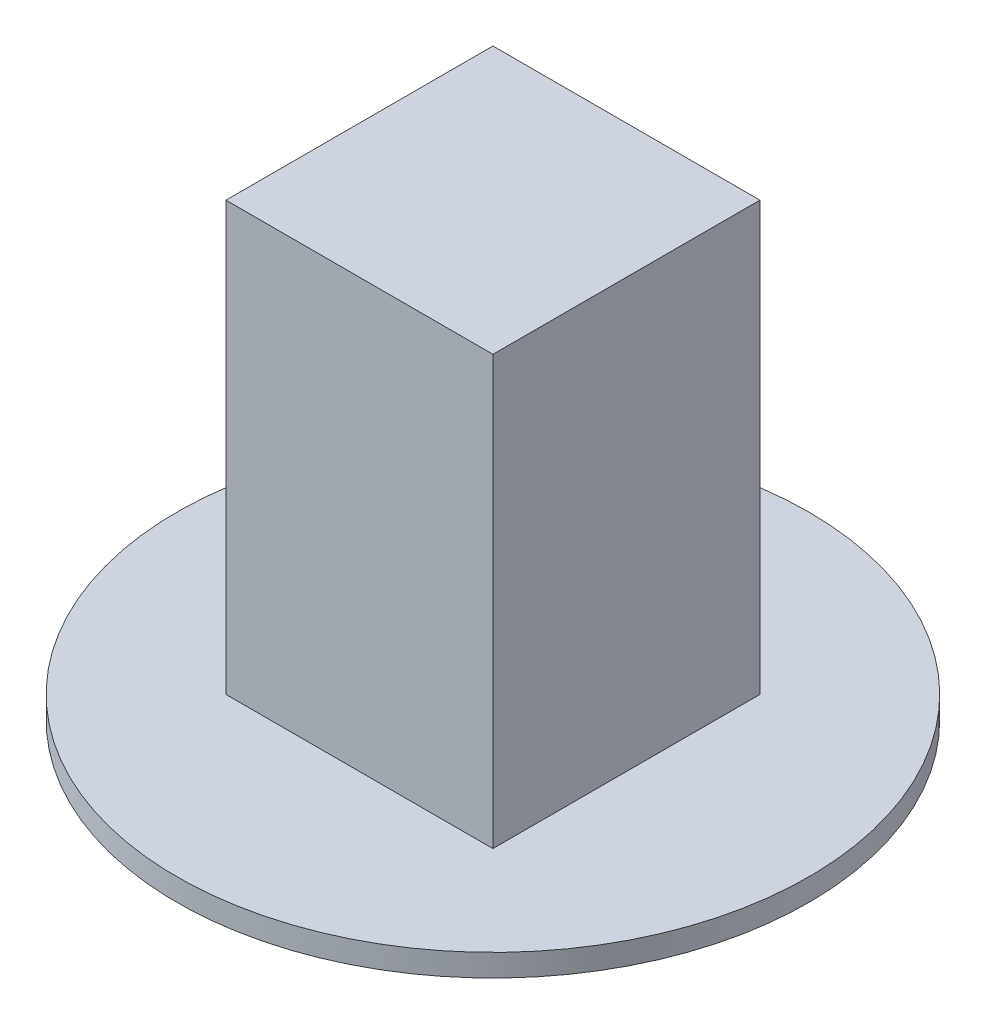
ISO-10303-21;
HEADER;
FILE_DESCRIPTION(('STEP AP214'),'2;1');
FILE_NAME('part.step','',(''),(''),'','','');
FILE_SCHEMA(('AUTOMOTIVE_DESIGN { 1 0 10303 214 1 1 1 1 }'));
ENDSEC;
DATA;
#1=APPLICATION_CONTEXT('core data for automotive mechanical design processes');
#2=APPLICATION_PROTOCOL_DEFINITION('international standard','automotive_design',2000,#1);
#3=PRODUCT_CONTEXT('',#1,'mechanical');
#4=PRODUCT('Part','Part','',(#3));
#5=PRODUCT_RELATED_PRODUCT_CATEGORY('part','',(#4));
#6=PRODUCT_DEFINITION_FORMATION('','',#4);
#7=PRODUCT_DEFINITION_CONTEXT('part definition',#1,'design');
#8=PRODUCT_DEFINITION('design','',#6,#7);
#9=PRODUCT_DEFINITION_SHAPE('','',#8);
#10=(LENGTH_UNIT() NAMED_UNIT(*) SI_UNIT(.MILLI.,.METRE.));
#11=(NAMED_UNIT(*) PLANE_ANGLE_UNIT() SI_UNIT($,.RADIAN.));
#12=(NAMED_UNIT(*) SI_UNIT($,.STERADIAN.) SOLID_ANGLE_UNIT());
#13=UNCERTAINTY_MEASURE_WITH_UNIT(LENGTH_MEASURE(1.E-05),#10,'distance_accuracy_value','');
#14=(GEOMETRIC_REPRESENTATION_CONTEXT(3) GLOBAL_UNCERTAINTY_ASSIGNED_CONTEXT((#13)) GLOBAL_UNIT_ASSIGNED_CONTEXT((#10,
#11,#12)) REPRESENTATION_CONTEXT('',''));
#15=CARTESIAN_POINT('',(0.,0.,0.));
#16=DIRECTION('',(0.,0.,1.));
#17=DIRECTION('',(1.,0.,0.));
#18=AXIS2_PLACEMENT_3D('',#15,#16,#17);
#19=CARTESIAN_POINT('',(-19.05,61.087,-19.05));
#20=DIRECTION('',(1.,0.,0.));
#21=DIRECTION('',(0.,0.,-1.));
#22=AXIS2_PLACEMENT_3D('',#19,#20,#21);
#23=PLANE('',#22);
#24=DIRECTION('',(0.,0.,1.));
#25=VECTOR('',#24,1.);
#26=CARTESIAN_POINT('',(-19.05,0.,-19.05));
#27=LINE('',#26,#25);
#28=CARTESIAN_POINT('',(-19.05,0.,-19.05));
#29=VERTEX_POINT('',#28);
#30=CARTESIAN_POINT('',(-19.05,0.,19.05));
#31=VERTEX_POINT('',#30);
#32=EDGE_CURVE('E74',#29,#31,#27,.T.);
#33=ORIENTED_EDGE('',*,*,#32,.T.);
#34=DIRECTION('',(0.,-1.,0.));
#35=VECTOR('',#34,1.);
#36=CARTESIAN_POINT('',(-19.05,61.087,19.05));
#37=LINE('',#36,#35);
#38=CARTESIAN_POINT('',(-19.05,61.087,19.05));
#39=VERTEX_POINT('',#38);
#40=EDGE_CURVE('E11',#39,#31,#37,.T.);
#41=ORIENTED_EDGE('',*,*,#40,.F.);
#42=DIRECTION('',(0.,0.,1.));
#43=VECTOR('',#42,1.);
#44=CARTESIAN_POINT('',(-19.05,61.087,-19.05));
#45=LINE('',#44,#43);
#46=CARTESIAN_POINT('',(-19.05,61.087,-19.05));
#47=VERTEX_POINT('',#46);
#48=EDGE_CURVE('E78',#47,#39,#45,.T.);
#49=ORIENTED_EDGE('',*,*,#48,.F.);
#50=DIRECTION('',(0.,-1.,0.));
#51=VECTOR('',#50,1.);
#52=CARTESIAN_POINT('',(-19.05,61.087,-19.05));
#53=LINE('',#52,#51);
#54=EDGE_CURVE('E90',#47,#29,#53,.T.);
#55=ORIENTED_EDGE('',*,*,#54,.T.);
#56=EDGE_LOOP('',(#33,#41,#49,#55));
#57=FACE_BOUND('',#56,.T.);
#58=ADVANCED_FACE('F32',(#57),#23,.F.);
#59=CARTESIAN_POINT('',(-19.05,61.087,19.05));
#60=DIRECTION('',(0.,0.,-1.));
#61=DIRECTION('',(-1.,0.,0.));
#62=AXIS2_PLACEMENT_3D('',#59,#60,#61);
#63=PLANE('',#62);
#64=DIRECTION('',(1.,0.,0.));
#65=VECTOR('',#64,1.);
#66=CARTESIAN_POINT('',(-19.05,0.,19.05));
#67=LINE('',#66,#65);
#68=CARTESIAN_POINT('',(19.05,0.,19.05));
#69=VERTEX_POINT('',#68);
#70=EDGE_CURVE('E87',#31,#69,#67,.T.);
#71=ORIENTED_EDGE('',*,*,#70,.T.);
#72=DIRECTION('',(0.,-1.,0.));
#73=VECTOR('',#72,1.);
#74=CARTESIAN_POINT('',(19.05,61.087,19.05));
#75=LINE('',#74,#73);
#76=CARTESIAN_POINT('',(19.05,61.087,19.05));
#77=VERTEX_POINT('',#76);
#78=EDGE_CURVE('E40',#77,#69,#75,.T.);
#79=ORIENTED_EDGE('',*,*,#78,.F.);
#80=DIRECTION('',(1.,0.,0.));
#81=VECTOR('',#80,1.);
#82=CARTESIAN_POINT('',(-19.05,61.087,19.05));
#83=LINE('',#82,#81);
#84=EDGE_CURVE('E100',#39,#77,#83,.T.);
#85=ORIENTED_EDGE('',*,*,#84,.F.);
#86=ORIENTED_EDGE('',*,*,#40,.T.);
#87=EDGE_LOOP('',(#71,#79,#85,#86));
#88=FACE_BOUND('',#87,.T.);
#89=ADVANCED_FACE('F126',(#88),#63,.F.);
#90=CARTESIAN_POINT('',(19.05,61.087,-19.05));
#91=DIRECTION('',(-1.,0.,0.));
#92=DIRECTION('',(0.,0.,1.));
#93=AXIS2_PLACEMENT_3D('',#90,#91,#92);
#94=PLANE('',#93);
#95=DIRECTION('',(0.,0.,-1.));
#96=VECTOR('',#95,1.);
#97=CARTESIAN_POINT('',(19.05,0.,-19.05));
#98=LINE('',#97,#96);
#99=CARTESIAN_POINT('',(19.05,0.,-19.05));
#100=VERTEX_POINT('',#99);
#101=EDGE_CURVE('E71',#69,#100,#98,.T.);
#102=ORIENTED_EDGE('',*,*,#101,.T.);
#103=DIRECTION('',(0.,-1.,0.));
#104=VECTOR('',#103,1.);
#105=CARTESIAN_POINT('',(19.05,61.087,-19.05));
#106=LINE('',#105,#104);
#107=CARTESIAN_POINT('',(19.05,61.087,-19.05));
#108=VERTEX_POINT('',#107);
#109=EDGE_CURVE('E85',#108,#100,#106,.T.);
#110=ORIENTED_EDGE('',*,*,#109,.F.);
#111=DIRECTION('',(0.,0.,-1.));
#112=VECTOR('',#111,1.);
#113=CARTESIAN_POINT('',(19.05,61.087,-19.05));
#114=LINE('',#113,#112);
#115=EDGE_CURVE('E98',#77,#108,#114,.T.);
#116=ORIENTED_EDGE('',*,*,#115,.F.);
#117=ORIENTED_EDGE('',*,*,#78,.T.);
#118=EDGE_LOOP('',(#102,#110,#116,#117));
#119=FACE_BOUND('',#118,.T.);
#120=ADVANCED_FACE('F83',(#119),#94,.F.);
#121=CARTESIAN_POINT('',(-19.05,61.087,-19.05));
#122=DIRECTION('',(0.,0.,1.));
#123=DIRECTION('',(1.,0.,0.));
#124=AXIS2_PLACEMENT_3D('',#121,#122,#123);
#125=PLANE('',#124);
#126=DIRECTION('',(-1.,0.,0.));
#127=VECTOR('',#126,1.);
#128=CARTESIAN_POINT('',(-19.05,0.,-19.05));
#129=LINE('',#128,#127);
#130=EDGE_CURVE('E68',#100,#29,#129,.T.);
#131=ORIENTED_EDGE('',*,*,#130,.T.);
#132=ORIENTED_EDGE('',*,*,#54,.F.);
#133=DIRECTION('',(-1.,0.,0.));
#134=VECTOR('',#133,1.);
#135=CARTESIAN_POINT('',(-19.05,61.087,-19.05));
#136=LINE('',#135,#134);
#137=EDGE_CURVE('E47',#108,#47,#136,.T.);
#138=ORIENTED_EDGE('',*,*,#137,.F.);
#139=ORIENTED_EDGE('',*,*,#109,.T.);
#140=EDGE_LOOP('',(#131,#132,#138,#139));
#141=FACE_BOUND('',#140,.T.);
#142=ADVANCED_FACE('F89',(#141),#125,.F.);
#143=CARTESIAN_POINT('',(0.,61.087,0.));
#144=DIRECTION('',(0.,1.,0.));
#145=DIRECTION('',(0.,0.,1.));
#146=AXIS2_PLACEMENT_3D('',#143,#144,#145);
#147=PLANE('',#146);
#148=ORIENTED_EDGE('',*,*,#48,.T.);
#149=ORIENTED_EDGE('',*,*,#84,.T.);
#150=ORIENTED_EDGE('',*,*,#115,.T.);
#151=ORIENTED_EDGE('',*,*,#137,.T.);
#152=EDGE_LOOP('',(#148,#149,#150,#151));
#153=FACE_BOUND('',#152,.T.);
#154=ADVANCED_FACE('F118',(#153),#147,.T.);
#155=CARTESIAN_POINT('',(0.,0.,0.));
#156=DIRECTION('',(0.,-1.,0.));
#157=DIRECTION('',(0.,0.,-1.));
#158=AXIS2_PLACEMENT_3D('',#155,#156,#157);
#159=PLANE('',#158);
#160=CARTESIAN_POINT('',(0.,0.,0.));
#161=DIRECTION('',(0.,-1.,0.));
#162=DIRECTION('',(0.,0.,-1.));
#163=AXIS2_PLACEMENT_3D('',#160,#161,#162);
#164=CIRCLE('',#163,45.085);
#165=CARTESIAN_POINT('',(0.,0.,-45.085));
#166=VERTEX_POINT('',#165);
#167=EDGE_CURVE('E103',#166,#166,#164,.T.);
#168=ORIENTED_EDGE('',*,*,#167,.F.);
#169=EDGE_LOOP('',(#168));
#170=FACE_BOUND('',#169,.T.);
#171=ORIENTED_EDGE('',*,*,#70,.F.);
#172=ORIENTED_EDGE('',*,*,#32,.F.);
#173=ORIENTED_EDGE('',*,*,#130,.F.);
#174=ORIENTED_EDGE('',*,*,#101,.F.);
#175=EDGE_LOOP('',(#171,#172,#173,#174));
#176=FACE_BOUND('',#175,.T.);
#177=ADVANCED_FACE('F70',(#170,#176),#159,.F.);
#178=CARTESIAN_POINT('',(0.,-3.175,0.));
#179=DIRECTION('',(0.,1.,0.));
#180=DIRECTION('',(0.,0.,1.));
#181=AXIS2_PLACEMENT_3D('',#178,#179,#180);
#182=CYLINDRICAL_SURFACE('',#181,45.085);
#183=CARTESIAN_POINT('',(0.,-3.175,0.));
#184=DIRECTION('',(0.,-1.,0.));
#185=DIRECTION('',(0.,0.,-1.));
#186=AXIS2_PLACEMENT_3D('',#183,#184,#185);
#187=CIRCLE('',#186,45.085);
#188=CARTESIAN_POINT('',(0.,-3.175,-45.085));
#189=VERTEX_POINT('',#188);
#190=EDGE_CURVE('E96',#189,#189,#187,.T.);
#191=ORIENTED_EDGE('',*,*,#190,.F.);
#192=EDGE_LOOP('',(#191));
#193=FACE_BOUND('',#192,.T.);
#194=ORIENTED_EDGE('',*,*,#167,.T.);
#195=EDGE_LOOP('',(#194));
#196=FACE_BOUND('',#195,.T.);
#197=ADVANCED_FACE('F111',(#193,#196),#182,.T.);
#198=CARTESIAN_POINT('',(0.,-3.175,0.));
#199=DIRECTION('',(0.,-1.,0.));
#200=DIRECTION('',(0.,0.,-1.));
#201=AXIS2_PLACEMENT_3D('',#198,#199,#200);
#202=PLANE('',#201);
#203=ORIENTED_EDGE('',*,*,#190,.T.);
#204=EDGE_LOOP('',(#203));
#205=FACE_BOUND('',#204,.T.);
#206=ADVANCED_FACE('F109',(#205),#202,.T.);
#207=CLOSED_SHELL('',(#58,#89,#120,#142,#154,#177,#197,#206));
#208=MANIFOLD_SOLID_BREP('B2',#207);
#209=ADVANCED_BREP_SHAPE_REPRESENTATION('',(#18,#208),#14);
#210=SHAPE_DEFINITION_REPRESENTATION(#9,#209);
ENDSEC;
END-ISO-10303-21;
